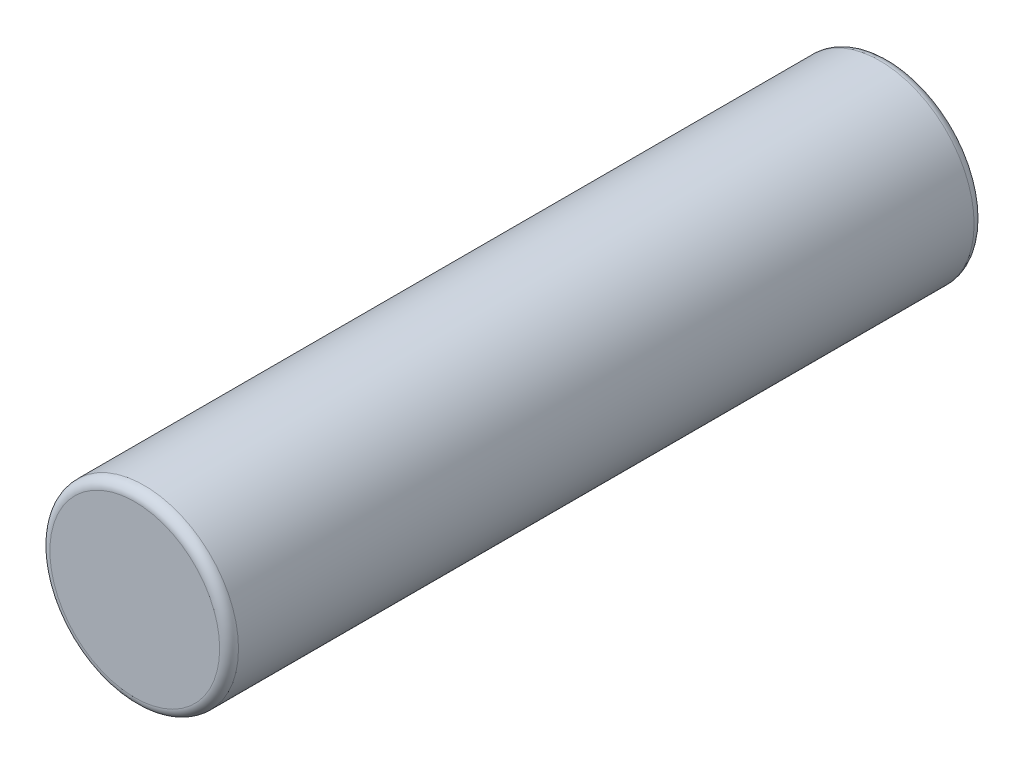
ISO-10303-21;
HEADER;
FILE_DESCRIPTION(('STEP AP214'),'2;1');
FILE_NAME('part.step','',(''),(''),'','','');
FILE_SCHEMA(('AUTOMOTIVE_DESIGN { 1 0 10303 214 1 1 1 1 }'));
ENDSEC;
DATA;
#1=APPLICATION_CONTEXT('core data for automotive mechanical design processes');
#2=APPLICATION_PROTOCOL_DEFINITION('international standard','automotive_design',2000,#1);
#3=PRODUCT_CONTEXT('',#1,'mechanical');
#4=PRODUCT('Part','Part','',(#3));
#5=PRODUCT_RELATED_PRODUCT_CATEGORY('part','',(#4));
#6=PRODUCT_DEFINITION_FORMATION('','',#4);
#7=PRODUCT_DEFINITION_CONTEXT('part definition',#1,'design');
#8=PRODUCT_DEFINITION('design','',#6,#7);
#9=PRODUCT_DEFINITION_SHAPE('','',#8);
#10=(LENGTH_UNIT() NAMED_UNIT(*) SI_UNIT(.MILLI.,.METRE.));
#11=(NAMED_UNIT(*) PLANE_ANGLE_UNIT() SI_UNIT($,.RADIAN.));
#12=(NAMED_UNIT(*) SI_UNIT($,.STERADIAN.) SOLID_ANGLE_UNIT());
#13=UNCERTAINTY_MEASURE_WITH_UNIT(LENGTH_MEASURE(1.E-05),#10,'distance_accuracy_value','');
#14=(GEOMETRIC_REPRESENTATION_CONTEXT(3) GLOBAL_UNCERTAINTY_ASSIGNED_CONTEXT((#13)) GLOBAL_UNIT_ASSIGNED_CONTEXT((#10,
#11,#12)) REPRESENTATION_CONTEXT('',''));
#15=CARTESIAN_POINT('',(0.,0.,0.));
#16=DIRECTION('',(0.,0.,1.));
#17=DIRECTION('',(1.,0.,0.));
#18=AXIS2_PLACEMENT_3D('',#15,#16,#17);
#19=CARTESIAN_POINT('',(0.,0.,8.));
#20=DIRECTION('',(0.,0.,-1.));
#21=DIRECTION('',(-1.,0.,0.));
#22=AXIS2_PLACEMENT_3D('',#19,#20,#21);
#23=CYLINDRICAL_SURFACE('',#22,1.);
#24=CARTESIAN_POINT('',(0.,0.,0.0999999999999994));
#25=DIRECTION('',(0.,0.,1.));
#26=DIRECTION('',(1.,0.,0.));
#27=AXIS2_PLACEMENT_3D('',#24,#25,#26);
#28=CIRCLE('',#27,1.);
#29=CARTESIAN_POINT('',(1.,0.,0.0999999999999994));
#30=VERTEX_POINT('',#29);
#31=EDGE_CURVE('E55',#30,#30,#28,.T.);
#32=ORIENTED_EDGE('',*,*,#31,.T.);
#33=EDGE_LOOP('',(#32));
#34=FACE_BOUND('',#33,.T.);
#35=CARTESIAN_POINT('',(0.,0.,7.9));
#36=DIRECTION('',(0.,0.,1.));
#37=DIRECTION('',(1.,0.,0.));
#38=AXIS2_PLACEMENT_3D('',#35,#36,#37);
#39=CIRCLE('',#38,1.);
#40=CARTESIAN_POINT('',(1.,0.,7.9));
#41=VERTEX_POINT('',#40);
#42=EDGE_CURVE('E60',#41,#41,#39,.F.);
#43=ORIENTED_EDGE('',*,*,#42,.T.);
#44=EDGE_LOOP('',(#43));
#45=FACE_BOUND('',#44,.T.);
#46=ADVANCED_FACE('F42',(#34,#45),#23,.T.);
#47=CARTESIAN_POINT('',(0.,0.,8.));
#48=DIRECTION('',(0.,0.,1.));
#49=DIRECTION('',(1.,0.,0.));
#50=AXIS2_PLACEMENT_3D('',#47,#48,#49);
#51=PLANE('',#50);
#52=CARTESIAN_POINT('',(0.,0.,8.));
#53=DIRECTION('',(0.,0.,1.));
#54=DIRECTION('',(1.,0.,0.));
#55=AXIS2_PLACEMENT_3D('',#52,#53,#54);
#56=CIRCLE('',#55,0.9);
#57=CARTESIAN_POINT('',(0.9,0.,8.));
#58=VERTEX_POINT('',#57);
#59=EDGE_CURVE('E10',#58,#58,#56,.T.);
#60=ORIENTED_EDGE('',*,*,#59,.T.);
#61=EDGE_LOOP('',(#60));
#62=FACE_BOUND('',#61,.T.);
#63=ADVANCED_FACE('F77',(#62),#51,.T.);
#64=CARTESIAN_POINT('',(0.,0.,0.));
#65=DIRECTION('',(0.,0.,1.));
#66=DIRECTION('',(1.,0.,0.));
#67=AXIS2_PLACEMENT_3D('',#64,#65,#66);
#68=PLANE('',#67);
#69=CARTESIAN_POINT('',(0.,0.,0.));
#70=DIRECTION('',(0.,0.,1.));
#71=DIRECTION('',(1.,0.,0.));
#72=AXIS2_PLACEMENT_3D('',#69,#70,#71);
#73=CIRCLE('',#72,0.9);
#74=CARTESIAN_POINT('',(0.9,0.,0.));
#75=VERTEX_POINT('',#74);
#76=EDGE_CURVE('E50',#75,#75,#73,.F.);
#77=ORIENTED_EDGE('',*,*,#76,.T.);
#78=EDGE_LOOP('',(#77));
#79=FACE_BOUND('',#78,.T.);
#80=ADVANCED_FACE('F74',(#79),#68,.F.);
#81=CARTESIAN_POINT('',(0.,0.,0.0999999999999994));
#82=DIRECTION('',(0.,0.,1.));
#83=DIRECTION('',(1.,0.,0.));
#84=AXIS2_PLACEMENT_3D('',#81,#82,#83);
#85=TOROIDAL_SURFACE('',#84,0.9,0.1);
#86=ORIENTED_EDGE('',*,*,#76,.F.);
#87=EDGE_LOOP('',(#86));
#88=FACE_BOUND('',#87,.T.);
#89=ORIENTED_EDGE('',*,*,#31,.F.);
#90=EDGE_LOOP('',(#89));
#91=FACE_BOUND('',#90,.T.);
#92=ADVANCED_FACE('F70',(#88,#91),#85,.T.);
#93=CARTESIAN_POINT('',(0.,0.,7.9));
#94=DIRECTION('',(0.,0.,1.));
#95=DIRECTION('',(1.,0.,0.));
#96=AXIS2_PLACEMENT_3D('',#93,#94,#95);
#97=TOROIDAL_SURFACE('',#96,0.9,0.1);
#98=ORIENTED_EDGE('',*,*,#42,.F.);
#99=EDGE_LOOP('',(#98));
#100=FACE_BOUND('',#99,.T.);
#101=ORIENTED_EDGE('',*,*,#59,.F.);
#102=EDGE_LOOP('',(#101));
#103=FACE_BOUND('',#102,.T.);
#104=ADVANCED_FACE('F44',(#100,#103),#97,.T.);
#105=CLOSED_SHELL('',(#46,#63,#80,#92,#104));
#106=MANIFOLD_SOLID_BREP('B2',#105);
#107=ADVANCED_BREP_SHAPE_REPRESENTATION('',(#18,#106),#14);
#108=SHAPE_DEFINITION_REPRESENTATION(#9,#107);
ENDSEC;
END-ISO-10303-21;
